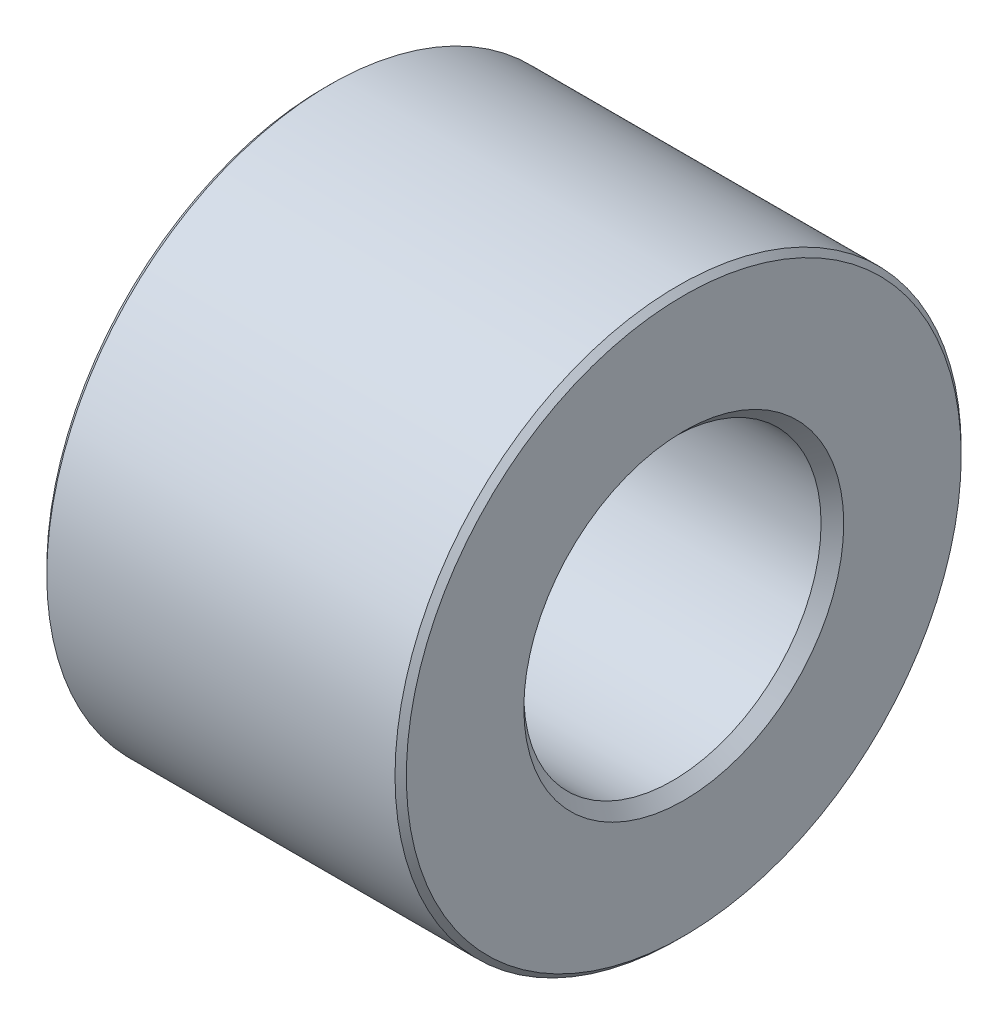
ISO-10303-21;
HEADER;
FILE_DESCRIPTION(('STEP AP214'),'2;1');
FILE_NAME('part.step','',(''),(''),'','','');
FILE_SCHEMA(('AUTOMOTIVE_DESIGN { 1 0 10303 214 1 1 1 1 }'));
ENDSEC;
DATA;
#1=APPLICATION_CONTEXT('core data for automotive mechanical design processes');
#2=APPLICATION_PROTOCOL_DEFINITION('international standard','automotive_design',2000,#1);
#3=PRODUCT_CONTEXT('',#1,'mechanical');
#4=PRODUCT('Part','Part','',(#3));
#5=PRODUCT_RELATED_PRODUCT_CATEGORY('part','',(#4));
#6=PRODUCT_DEFINITION_FORMATION('','',#4);
#7=PRODUCT_DEFINITION_CONTEXT('part definition',#1,'design');
#8=PRODUCT_DEFINITION('design','',#6,#7);
#9=PRODUCT_DEFINITION_SHAPE('','',#8);
#10=(LENGTH_UNIT() NAMED_UNIT(*) SI_UNIT(.MILLI.,.METRE.));
#11=(NAMED_UNIT(*) PLANE_ANGLE_UNIT() SI_UNIT($,.RADIAN.));
#12=(NAMED_UNIT(*) SI_UNIT($,.STERADIAN.) SOLID_ANGLE_UNIT());
#13=UNCERTAINTY_MEASURE_WITH_UNIT(LENGTH_MEASURE(1.E-05),#10,'distance_accuracy_value','');
#14=(GEOMETRIC_REPRESENTATION_CONTEXT(3) GLOBAL_UNCERTAINTY_ASSIGNED_CONTEXT((#13)) GLOBAL_UNIT_ASSIGNED_CONTEXT((#10,
#11,#12)) REPRESENTATION_CONTEXT('',''));
#15=CARTESIAN_POINT('',(0.,0.,0.));
#16=DIRECTION('',(0.,0.,1.));
#17=DIRECTION('',(1.,0.,0.));
#18=AXIS2_PLACEMENT_3D('',#15,#16,#17);
#19=CARTESIAN_POINT('',(3.175,0.,0.));
#20=DIRECTION('',(1.,0.,0.));
#21=DIRECTION('',(0.,0.,-1.));
#22=AXIS2_PLACEMENT_3D('',#19,#20,#21);
#23=PLANE('',#22);
#24=CARTESIAN_POINT('',(3.175,0.,0.));
#25=DIRECTION('',(1.,0.,0.));
#26=DIRECTION('',(0.,0.,-1.));
#27=AXIS2_PLACEMENT_3D('',#24,#25,#26);
#28=CIRCLE('',#27,4.9);
#29=CARTESIAN_POINT('',(3.175,0.,-4.9));
#30=VERTEX_POINT('',#29);
#31=EDGE_CURVE('E8',#30,#30,#28,.T.);
#32=ORIENTED_EDGE('',*,*,#31,.T.);
#33=EDGE_LOOP('',(#32));
#34=FACE_BOUND('',#33,.T.);
#35=CARTESIAN_POINT('',(3.175,0.,0.));
#36=DIRECTION('',(1.,0.,0.));
#37=DIRECTION('',(0.,0.,-1.));
#38=AXIS2_PLACEMENT_3D('',#35,#36,#37);
#39=CIRCLE('',#38,2.825);
#40=CARTESIAN_POINT('',(3.175,0.,-2.825));
#41=VERTEX_POINT('',#40);
#42=EDGE_CURVE('E33',#41,#41,#39,.F.);
#43=ORIENTED_EDGE('',*,*,#42,.T.);
#44=EDGE_LOOP('',(#43));
#45=FACE_BOUND('',#44,.T.);
#46=ADVANCED_FACE('F13',(#34,#45),#23,.T.);
#47=CARTESIAN_POINT('',(-3.175,0.,0.));
#48=DIRECTION('',(1.,0.,0.));
#49=DIRECTION('',(0.,0.,-1.));
#50=AXIS2_PLACEMENT_3D('',#47,#48,#49);
#51=PLANE('',#50);
#52=CARTESIAN_POINT('',(-3.175,0.,0.));
#53=DIRECTION('',(1.,0.,0.));
#54=DIRECTION('',(0.,0.,-1.));
#55=AXIS2_PLACEMENT_3D('',#52,#53,#54);
#56=CIRCLE('',#55,4.9);
#57=CARTESIAN_POINT('',(-3.175,0.,-4.9));
#58=VERTEX_POINT('',#57);
#59=EDGE_CURVE('E20',#58,#58,#56,.F.);
#60=ORIENTED_EDGE('',*,*,#59,.T.);
#61=EDGE_LOOP('',(#60));
#62=FACE_BOUND('',#61,.T.);
#63=CARTESIAN_POINT('',(-3.175,0.,0.));
#64=DIRECTION('',(1.,0.,0.));
#65=DIRECTION('',(0.,0.,-1.));
#66=AXIS2_PLACEMENT_3D('',#63,#64,#65);
#67=CIRCLE('',#66,2.625);
#68=CARTESIAN_POINT('',(-3.175,0.,-2.625));
#69=VERTEX_POINT('',#68);
#70=EDGE_CURVE('E39',#69,#69,#67,.T.);
#71=ORIENTED_EDGE('',*,*,#70,.T.);
#72=EDGE_LOOP('',(#71));
#73=FACE_BOUND('',#72,.T.);
#74=ADVANCED_FACE('F43',(#62,#73),#51,.F.);
#75=CARTESIAN_POINT('',(3.175,0.,0.));
#76=DIRECTION('',(-1.,0.,0.));
#77=DIRECTION('',(0.,0.,1.));
#78=AXIS2_PLACEMENT_3D('',#75,#76,#77);
#79=CYLINDRICAL_SURFACE('',#78,5.);
#80=CARTESIAN_POINT('',(-3.075,0.,0.));
#81=DIRECTION('',(1.,0.,0.));
#82=DIRECTION('',(0.,0.,-1.));
#83=AXIS2_PLACEMENT_3D('',#80,#81,#82);
#84=CIRCLE('',#83,5.);
#85=CARTESIAN_POINT('',(-3.075,0.,-5.));
#86=VERTEX_POINT('',#85);
#87=EDGE_CURVE('E24',#86,#86,#84,.T.);
#88=ORIENTED_EDGE('',*,*,#87,.T.);
#89=EDGE_LOOP('',(#88));
#90=FACE_BOUND('',#89,.T.);
#91=CARTESIAN_POINT('',(3.075,0.,0.));
#92=DIRECTION('',(1.,0.,0.));
#93=DIRECTION('',(0.,0.,-1.));
#94=AXIS2_PLACEMENT_3D('',#91,#92,#93);
#95=CIRCLE('',#94,5.);
#96=CARTESIAN_POINT('',(3.075,0.,-5.));
#97=VERTEX_POINT('',#96);
#98=EDGE_CURVE('E28',#97,#97,#95,.F.);
#99=ORIENTED_EDGE('',*,*,#98,.T.);
#100=EDGE_LOOP('',(#99));
#101=FACE_BOUND('',#100,.T.);
#102=ADVANCED_FACE('F48',(#90,#101),#79,.T.);
#103=CARTESIAN_POINT('',(3.175,0.,0.));
#104=DIRECTION('',(-1.,0.,0.));
#105=DIRECTION('',(0.,0.,1.));
#106=AXIS2_PLACEMENT_3D('',#103,#104,#105);
#107=CYLINDRICAL_SURFACE('',#106,2.625);
#108=CARTESIAN_POINT('',(2.975,0.,0.));
#109=DIRECTION('',(1.,0.,0.));
#110=DIRECTION('',(0.,0.,-1.));
#111=AXIS2_PLACEMENT_3D('',#108,#109,#110);
#112=CIRCLE('',#111,2.625);
#113=CARTESIAN_POINT('',(2.975,0.,-2.625));
#114=VERTEX_POINT('',#113);
#115=EDGE_CURVE('E36',#114,#114,#112,.T.);
#116=ORIENTED_EDGE('',*,*,#115,.T.);
#117=EDGE_LOOP('',(#116));
#118=FACE_BOUND('',#117,.T.);
#119=ORIENTED_EDGE('',*,*,#70,.F.);
#120=EDGE_LOOP('',(#119));
#121=FACE_BOUND('',#120,.T.);
#122=ADVANCED_FACE('F45',(#118,#121),#107,.F.);
#123=CARTESIAN_POINT('',(2.975,0.,0.));
#124=DIRECTION('',(1.,0.,0.));
#125=DIRECTION('',(0.,0.,-1.));
#126=AXIS2_PLACEMENT_3D('',#123,#124,#125);
#127=CONICAL_SURFACE('',#126,2.625,0.785398163397455);
#128=ORIENTED_EDGE('',*,*,#42,.F.);
#129=EDGE_LOOP('',(#128));
#130=FACE_BOUND('',#129,.T.);
#131=ORIENTED_EDGE('',*,*,#115,.F.);
#132=EDGE_LOOP('',(#131));
#133=FACE_BOUND('',#132,.T.);
#134=ADVANCED_FACE('F47',(#130,#133),#127,.F.);
#135=CARTESIAN_POINT('',(-3.075,0.,0.));
#136=DIRECTION('',(1.,0.,0.));
#137=DIRECTION('',(0.,0.,-1.));
#138=AXIS2_PLACEMENT_3D('',#135,#136,#137);
#139=CONICAL_SURFACE('',#138,5.,0.785398163397444);
#140=ORIENTED_EDGE('',*,*,#59,.F.);
#141=EDGE_LOOP('',(#140));
#142=FACE_BOUND('',#141,.T.);
#143=ORIENTED_EDGE('',*,*,#87,.F.);
#144=EDGE_LOOP('',(#143));
#145=FACE_BOUND('',#144,.T.);
#146=ADVANCED_FACE('F56',(#142,#145),#139,.T.);
#147=CARTESIAN_POINT('',(3.175,0.,0.));
#148=DIRECTION('',(-1.,0.,0.));
#149=DIRECTION('',(0.,0.,1.));
#150=AXIS2_PLACEMENT_3D('',#147,#148,#149);
#151=CONICAL_SURFACE('',#150,4.9,0.785398163397448);
#152=ORIENTED_EDGE('',*,*,#98,.F.);
#153=EDGE_LOOP('',(#152));
#154=FACE_BOUND('',#153,.T.);
#155=ORIENTED_EDGE('',*,*,#31,.F.);
#156=EDGE_LOOP('',(#155));
#157=FACE_BOUND('',#156,.T.);
#158=ADVANCED_FACE('F15',(#154,#157),#151,.T.);
#159=CLOSED_SHELL('',(#46,#74,#102,#122,#134,#146,#158));
#160=MANIFOLD_SOLID_BREP('B1',#159);
#161=ADVANCED_BREP_SHAPE_REPRESENTATION('',(#18,#160),#14);
#162=SHAPE_DEFINITION_REPRESENTATION(#9,#161);
ENDSEC;
END-ISO-10303-21;
